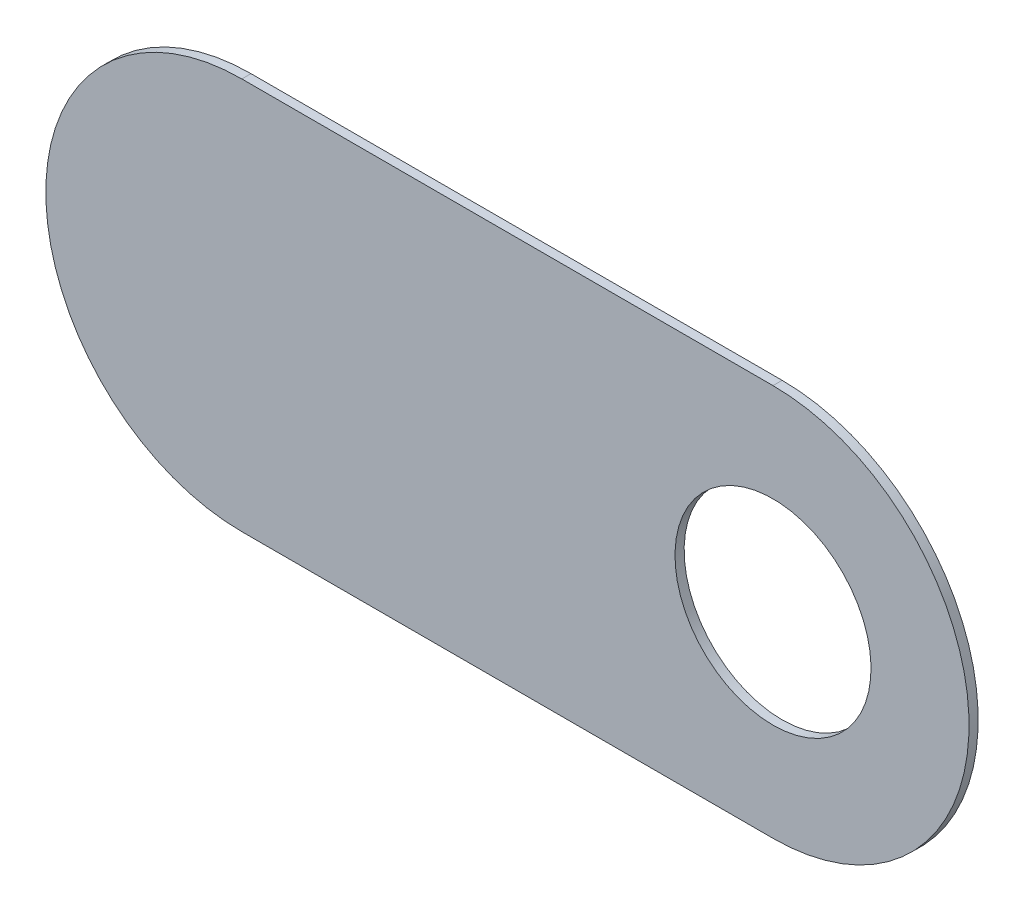
ISO-10303-21;
HEADER;
FILE_DESCRIPTION(('STEP AP214'),'2;1');
FILE_NAME('part.step','',(''),(''),'','','');
FILE_SCHEMA(('AUTOMOTIVE_DESIGN { 1 0 10303 214 1 1 1 1 }'));
ENDSEC;
DATA;
#1=APPLICATION_CONTEXT('core data for automotive mechanical design processes');
#2=APPLICATION_PROTOCOL_DEFINITION('international standard','automotive_design',2000,#1);
#3=PRODUCT_CONTEXT('',#1,'mechanical');
#4=PRODUCT('Part','Part','',(#3));
#5=PRODUCT_RELATED_PRODUCT_CATEGORY('part','',(#4));
#6=PRODUCT_DEFINITION_FORMATION('','',#4);
#7=PRODUCT_DEFINITION_CONTEXT('part definition',#1,'design');
#8=PRODUCT_DEFINITION('design','',#6,#7);
#9=PRODUCT_DEFINITION_SHAPE('','',#8);
#10=(LENGTH_UNIT() NAMED_UNIT(*) SI_UNIT(.MILLI.,.METRE.));
#11=(NAMED_UNIT(*) PLANE_ANGLE_UNIT() SI_UNIT($,.RADIAN.));
#12=(NAMED_UNIT(*) SI_UNIT($,.STERADIAN.) SOLID_ANGLE_UNIT());
#13=UNCERTAINTY_MEASURE_WITH_UNIT(LENGTH_MEASURE(1.E-05),#10,'distance_accuracy_value','');
#14=(GEOMETRIC_REPRESENTATION_CONTEXT(3) GLOBAL_UNCERTAINTY_ASSIGNED_CONTEXT((#13)) GLOBAL_UNIT_ASSIGNED_CONTEXT((#10,
#11,#12)) REPRESENTATION_CONTEXT('',''));
#15=CARTESIAN_POINT('',(0.,0.,0.));
#16=DIRECTION('',(0.,0.,1.));
#17=DIRECTION('',(1.,0.,0.));
#18=AXIS2_PLACEMENT_3D('',#15,#16,#17);
#19=CARTESIAN_POINT('',(117.856,-120.396,-0.045));
#20=DIRECTION('',(0.,0.,-1.));
#21=DIRECTION('',(0.,-1.,0.));
#22=AXIS2_PLACEMENT_3D('',#19,#20,#21);
#23=CYLINDRICAL_SURFACE('',#22,0.375);
#24=CARTESIAN_POINT('',(117.856,-120.396,-0.035));
#25=DIRECTION('',(0.,0.,-1.));
#26=DIRECTION('',(0.,-1.,0.));
#27=AXIS2_PLACEMENT_3D('',#24,#25,#26);
#28=CIRCLE('',#27,0.375);
#29=CARTESIAN_POINT('',(117.856,-120.771,-0.035));
#30=VERTEX_POINT('',#29);
#31=EDGE_CURVE('E114',#30,#30,#28,.T.);
#32=ORIENTED_EDGE('',*,*,#31,.T.);
#33=DIRECTION('',(0.,0.,1.));
#34=VECTOR('',#33,1.);
#35=CARTESIAN_POINT('',(117.856,-120.771,-0.045));
#36=LINE('',#35,#34);
#37=CARTESIAN_POINT('',(117.856,-120.771,0.));
#38=VERTEX_POINT('',#37);
#39=EDGE_CURVE('E11',#30,#38,#36,.T.);
#40=ORIENTED_EDGE('',*,*,#39,.T.);
#41=CARTESIAN_POINT('',(117.856,-120.396,0.));
#42=DIRECTION('',(0.,0.,-1.));
#43=DIRECTION('',(0.,-1.,0.));
#44=AXIS2_PLACEMENT_3D('',#41,#42,#43);
#45=CIRCLE('',#44,0.375);
#46=EDGE_CURVE('E25',#38,#38,#45,.T.);
#47=ORIENTED_EDGE('',*,*,#46,.F.);
#48=ORIENTED_EDGE('',*,*,#39,.F.);
#49=EDGE_LOOP('',(#32,#40,#47,#48));
#50=FACE_BOUND('',#49,.T.);
#51=ADVANCED_FACE('F17',(#50),#23,.F.);
#52=CARTESIAN_POINT('',(117.856,-119.646,-0.035));
#53=DIRECTION('',(0.,-1.,0.));
#54=DIRECTION('',(0.,0.,-1.));
#55=AXIS2_PLACEMENT_3D('',#52,#53,#54);
#56=PLANE('',#55);
#57=DIRECTION('',(-1.,0.,0.));
#58=VECTOR('',#57,1.);
#59=CARTESIAN_POINT('',(117.856,-119.646,-0.035));
#60=LINE('',#59,#58);
#61=CARTESIAN_POINT('',(117.856,-119.646,-0.035));
#62=VERTEX_POINT('',#61);
#63=CARTESIAN_POINT('',(115.824,-119.646,-0.035));
#64=VERTEX_POINT('',#63);
#65=EDGE_CURVE('E118',#62,#64,#60,.T.);
#66=ORIENTED_EDGE('',*,*,#65,.T.);
#67=DIRECTION('',(0.,0.,1.));
#68=VECTOR('',#67,1.);
#69=CARTESIAN_POINT('',(115.824,-119.646,-0.035));
#70=LINE('',#69,#68);
#71=CARTESIAN_POINT('',(115.824,-119.646,0.));
#72=VERTEX_POINT('',#71);
#73=EDGE_CURVE('E83',#64,#72,#70,.T.);
#74=ORIENTED_EDGE('',*,*,#73,.T.);
#75=DIRECTION('',(-1.,0.,0.));
#76=VECTOR('',#75,1.);
#77=CARTESIAN_POINT('',(117.856,-119.646,0.));
#78=LINE('',#77,#76);
#79=CARTESIAN_POINT('',(117.856,-119.646,0.));
#80=VERTEX_POINT('',#79);
#81=EDGE_CURVE('E117',#80,#72,#78,.T.);
#82=ORIENTED_EDGE('',*,*,#81,.F.);
#83=DIRECTION('',(0.,0.,1.));
#84=VECTOR('',#83,1.);
#85=CARTESIAN_POINT('',(117.856,-119.646,-0.035));
#86=LINE('',#85,#84);
#87=EDGE_CURVE('E127',#62,#80,#86,.T.);
#88=ORIENTED_EDGE('',*,*,#87,.F.);
#89=EDGE_LOOP('',(#66,#74,#82,#88));
#90=FACE_BOUND('',#89,.T.);
#91=ADVANCED_FACE('F139',(#90),#56,.F.);
#92=CARTESIAN_POINT('',(115.824,-121.146,0.));
#93=DIRECTION('',(0.,0.,1.));
#94=DIRECTION('',(1.,0.,0.));
#95=AXIS2_PLACEMENT_3D('',#92,#93,#94);
#96=PLANE('',#95);
#97=ORIENTED_EDGE('',*,*,#46,.T.);
#98=EDGE_LOOP('',(#97));
#99=FACE_BOUND('',#98,.T.);
#100=DIRECTION('',(1.,0.,0.));
#101=VECTOR('',#100,1.);
#102=CARTESIAN_POINT('',(115.824,-121.146,0.));
#103=LINE('',#102,#101);
#104=CARTESIAN_POINT('',(115.824,-121.146,0.));
#105=VERTEX_POINT('',#104);
#106=CARTESIAN_POINT('',(117.856,-121.146,0.));
#107=VERTEX_POINT('',#106);
#108=EDGE_CURVE('E95',#105,#107,#103,.T.);
#109=ORIENTED_EDGE('',*,*,#108,.T.);
#110=CARTESIAN_POINT('',(117.856,-120.396,0.));
#111=DIRECTION('',(0.,0.,1.));
#112=DIRECTION('',(0.,-1.,0.));
#113=AXIS2_PLACEMENT_3D('',#110,#111,#112);
#114=CIRCLE('',#113,0.75);
#115=EDGE_CURVE('E131',#107,#80,#114,.T.);
#116=ORIENTED_EDGE('',*,*,#115,.T.);
#117=ORIENTED_EDGE('',*,*,#81,.T.);
#118=CARTESIAN_POINT('',(115.824,-120.396,0.));
#119=DIRECTION('',(0.,0.,1.));
#120=DIRECTION('',(0.,1.,0.));
#121=AXIS2_PLACEMENT_3D('',#118,#119,#120);
#122=CIRCLE('',#121,0.75);
#123=EDGE_CURVE('E87',#72,#105,#122,.T.);
#124=ORIENTED_EDGE('',*,*,#123,.T.);
#125=EDGE_LOOP('',(#109,#116,#117,#124));
#126=FACE_BOUND('',#125,.T.);
#127=ADVANCED_FACE('F143',(#99,#126),#96,.T.);
#128=CARTESIAN_POINT('',(115.824,-121.146,-0.035));
#129=DIRECTION('',(0.,0.,1.));
#130=DIRECTION('',(1.,0.,0.));
#131=AXIS2_PLACEMENT_3D('',#128,#129,#130);
#132=PLANE('',#131);
#133=ORIENTED_EDGE('',*,*,#31,.F.);
#134=EDGE_LOOP('',(#133));
#135=FACE_BOUND('',#134,.T.);
#136=CARTESIAN_POINT('',(115.824,-120.396,-0.035));
#137=DIRECTION('',(0.,0.,1.));
#138=DIRECTION('',(0.,1.,0.));
#139=AXIS2_PLACEMENT_3D('',#136,#137,#138);
#140=CIRCLE('',#139,0.75);
#141=CARTESIAN_POINT('',(115.824,-121.146,-0.035));
#142=VERTEX_POINT('',#141);
#143=EDGE_CURVE('E76',#64,#142,#140,.T.);
#144=ORIENTED_EDGE('',*,*,#143,.F.);
#145=ORIENTED_EDGE('',*,*,#65,.F.);
#146=CARTESIAN_POINT('',(117.856,-120.396,-0.035));
#147=DIRECTION('',(0.,0.,1.));
#148=DIRECTION('',(0.,-1.,0.));
#149=AXIS2_PLACEMENT_3D('',#146,#147,#148);
#150=CIRCLE('',#149,0.75);
#151=CARTESIAN_POINT('',(117.856,-121.146,-0.035));
#152=VERTEX_POINT('',#151);
#153=EDGE_CURVE('E100',#152,#62,#150,.T.);
#154=ORIENTED_EDGE('',*,*,#153,.F.);
#155=DIRECTION('',(1.,0.,0.));
#156=VECTOR('',#155,1.);
#157=CARTESIAN_POINT('',(115.824,-121.146,-0.035));
#158=LINE('',#157,#156);
#159=EDGE_CURVE('E93',#142,#152,#158,.T.);
#160=ORIENTED_EDGE('',*,*,#159,.F.);
#161=EDGE_LOOP('',(#144,#145,#154,#160));
#162=FACE_BOUND('',#161,.T.);
#163=ADVANCED_FACE('F98',(#135,#162),#132,.F.);
#164=CARTESIAN_POINT('',(117.856,-120.396,-0.035));
#165=DIRECTION('',(0.,0.,-1.));
#166=DIRECTION('',(0.,-1.,0.));
#167=AXIS2_PLACEMENT_3D('',#164,#165,#166);
#168=CYLINDRICAL_SURFACE('',#167,0.75);
#169=ORIENTED_EDGE('',*,*,#153,.T.);
#170=ORIENTED_EDGE('',*,*,#87,.T.);
#171=ORIENTED_EDGE('',*,*,#115,.F.);
#172=DIRECTION('',(0.,0.,1.));
#173=VECTOR('',#172,1.);
#174=CARTESIAN_POINT('',(117.856,-121.146,-0.035));
#175=LINE('',#174,#173);
#176=EDGE_CURVE('E103',#152,#107,#175,.T.);
#177=ORIENTED_EDGE('',*,*,#176,.F.);
#178=EDGE_LOOP('',(#169,#170,#171,#177));
#179=FACE_BOUND('',#178,.T.);
#180=ADVANCED_FACE('F141',(#179),#168,.T.);
#181=CARTESIAN_POINT('',(115.824,-120.396,-0.035));
#182=DIRECTION('',(0.,0.,-1.));
#183=DIRECTION('',(0.,1.,0.));
#184=AXIS2_PLACEMENT_3D('',#181,#182,#183);
#185=CYLINDRICAL_SURFACE('',#184,0.75);
#186=ORIENTED_EDGE('',*,*,#143,.T.);
#187=DIRECTION('',(0.,0.,1.));
#188=VECTOR('',#187,1.);
#189=CARTESIAN_POINT('',(115.824,-121.146,-0.035));
#190=LINE('',#189,#188);
#191=EDGE_CURVE('E80',#142,#105,#190,.T.);
#192=ORIENTED_EDGE('',*,*,#191,.T.);
#193=ORIENTED_EDGE('',*,*,#123,.F.);
#194=ORIENTED_EDGE('',*,*,#73,.F.);
#195=EDGE_LOOP('',(#186,#192,#193,#194));
#196=FACE_BOUND('',#195,.T.);
#197=ADVANCED_FACE('F78',(#196),#185,.T.);
#198=CARTESIAN_POINT('',(115.824,-121.146,-0.035));
#199=DIRECTION('',(0.,1.,0.));
#200=DIRECTION('',(1.,0.,0.));
#201=AXIS2_PLACEMENT_3D('',#198,#199,#200);
#202=PLANE('',#201);
#203=ORIENTED_EDGE('',*,*,#159,.T.);
#204=ORIENTED_EDGE('',*,*,#176,.T.);
#205=ORIENTED_EDGE('',*,*,#108,.F.);
#206=ORIENTED_EDGE('',*,*,#191,.F.);
#207=EDGE_LOOP('',(#203,#204,#205,#206));
#208=FACE_BOUND('',#207,.T.);
#209=ADVANCED_FACE('F91',(#208),#202,.F.);
#210=CLOSED_SHELL('',(#51,#91,#127,#163,#180,#197,#209));
#211=MANIFOLD_SOLID_BREP('B1',#210);
#212=ADVANCED_BREP_SHAPE_REPRESENTATION('',(#18,#211),#14);
#213=SHAPE_DEFINITION_REPRESENTATION(#9,#212);
ENDSEC;
END-ISO-10303-21;
